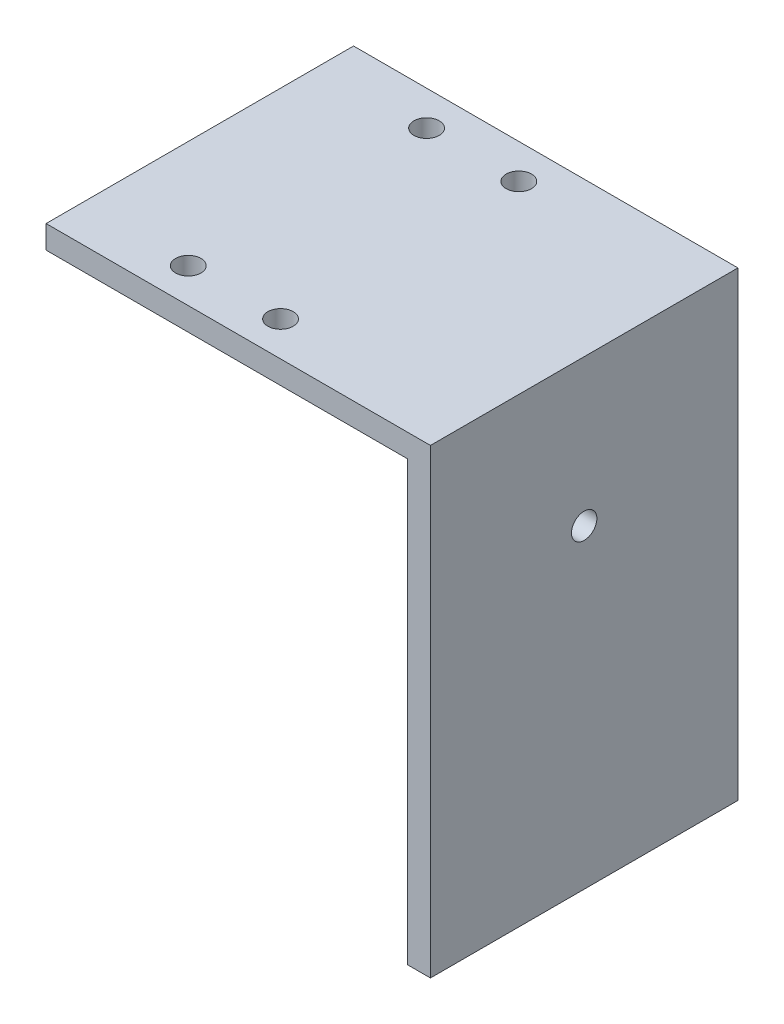
ISO-10303-21;
HEADER;
FILE_DESCRIPTION(('STEP AP214'),'2;1');
FILE_NAME('part.step','',(''),(''),'','','');
FILE_SCHEMA(('AUTOMOTIVE_DESIGN { 1 0 10303 214 1 1 1 1 }'));
ENDSEC;
DATA;
#1=APPLICATION_CONTEXT('core data for automotive mechanical design processes');
#2=APPLICATION_PROTOCOL_DEFINITION('international standard','automotive_design',2000,#1);
#3=PRODUCT_CONTEXT('',#1,'mechanical');
#4=PRODUCT('Part','Part','',(#3));
#5=PRODUCT_RELATED_PRODUCT_CATEGORY('part','',(#4));
#6=PRODUCT_DEFINITION_FORMATION('','',#4);
#7=PRODUCT_DEFINITION_CONTEXT('part definition',#1,'design');
#8=PRODUCT_DEFINITION('design','',#6,#7);
#9=PRODUCT_DEFINITION_SHAPE('','',#8);
#10=(LENGTH_UNIT() NAMED_UNIT(*) SI_UNIT(.MILLI.,.METRE.));
#11=(NAMED_UNIT(*) PLANE_ANGLE_UNIT() SI_UNIT($,.RADIAN.));
#12=(NAMED_UNIT(*) SI_UNIT($,.STERADIAN.) SOLID_ANGLE_UNIT());
#13=UNCERTAINTY_MEASURE_WITH_UNIT(LENGTH_MEASURE(1.E-05),#10,'distance_accuracy_value','');
#14=(GEOMETRIC_REPRESENTATION_CONTEXT(3) GLOBAL_UNCERTAINTY_ASSIGNED_CONTEXT((#13)) GLOBAL_UNIT_ASSIGNED_CONTEXT((#10,
#11,#12)) REPRESENTATION_CONTEXT('',''));
#15=CARTESIAN_POINT('',(0.,0.,0.));
#16=DIRECTION('',(0.,0.,1.));
#17=DIRECTION('',(1.,0.,0.));
#18=AXIS2_PLACEMENT_3D('',#15,#16,#17);
#19=CARTESIAN_POINT('',(0.,0.,40.));
#20=DIRECTION('',(1.,0.,0.));
#21=DIRECTION('',(0.,0.,-1.));
#22=AXIS2_PLACEMENT_3D('',#19,#20,#21);
#23=PLANE('',#22);
#24=DIRECTION('',(0.,-1.,0.));
#25=VECTOR('',#24,1.);
#26=CARTESIAN_POINT('',(0.,0.,0.));
#27=LINE('',#26,#25);
#28=CARTESIAN_POINT('',(0.,0.,0.));
#29=VERTEX_POINT('',#28);
#30=CARTESIAN_POINT('',(0.,-3.,0.));
#31=VERTEX_POINT('',#30);
#32=EDGE_CURVE('E122',#29,#31,#27,.T.);
#33=ORIENTED_EDGE('',*,*,#32,.T.);
#34=DIRECTION('',(0.,0.,-1.));
#35=VECTOR('',#34,1.);
#36=CARTESIAN_POINT('',(0.,-3.,40.));
#37=LINE('',#36,#35);
#38=CARTESIAN_POINT('',(0.,-3.,40.));
#39=VERTEX_POINT('',#38);
#40=EDGE_CURVE('E11',#39,#31,#37,.T.);
#41=ORIENTED_EDGE('',*,*,#40,.F.);
#42=DIRECTION('',(0.,-1.,0.));
#43=VECTOR('',#42,1.);
#44=CARTESIAN_POINT('',(0.,0.,40.));
#45=LINE('',#44,#43);
#46=CARTESIAN_POINT('',(0.,0.,40.));
#47=VERTEX_POINT('',#46);
#48=EDGE_CURVE('E133',#47,#39,#45,.T.);
#49=ORIENTED_EDGE('',*,*,#48,.F.);
#50=DIRECTION('',(0.,0.,-1.));
#51=VECTOR('',#50,1.);
#52=CARTESIAN_POINT('',(0.,0.,40.));
#53=LINE('',#52,#51);
#54=EDGE_CURVE('E118',#47,#29,#53,.T.);
#55=ORIENTED_EDGE('',*,*,#54,.T.);
#56=EDGE_LOOP('',(#33,#41,#49,#55));
#57=FACE_BOUND('',#56,.T.);
#58=ADVANCED_FACE('F38',(#57),#23,.F.);
#59=CARTESIAN_POINT('',(0.,-3.,40.));
#60=DIRECTION('',(0.,1.,0.));
#61=DIRECTION('',(0.,0.,1.));
#62=AXIS2_PLACEMENT_3D('',#59,#60,#61);
#63=PLANE('',#62);
#64=CARTESIAN_POINT('',(14.,-3.,35.5));
#65=DIRECTION('',(0.,1.,0.));
#66=DIRECTION('',(0.,0.,1.));
#67=AXIS2_PLACEMENT_3D('',#64,#65,#66);
#68=CIRCLE('',#67,1.65);
#69=CARTESIAN_POINT('',(14.,-3.,37.15));
#70=VERTEX_POINT('',#69);
#71=EDGE_CURVE('E126',#70,#70,#68,.T.);
#72=ORIENTED_EDGE('',*,*,#71,.T.);
#73=EDGE_LOOP('',(#72));
#74=FACE_BOUND('',#73,.T.);
#75=CARTESIAN_POINT('',(26.,-3.,4.5));
#76=DIRECTION('',(0.,1.,0.));
#77=DIRECTION('',(0.,0.,1.));
#78=AXIS2_PLACEMENT_3D('',#75,#76,#77);
#79=CIRCLE('',#78,1.65);
#80=CARTESIAN_POINT('',(26.,-3.,6.15));
#81=VERTEX_POINT('',#80);
#82=EDGE_CURVE('E279',#81,#81,#79,.T.);
#83=ORIENTED_EDGE('',*,*,#82,.T.);
#84=EDGE_LOOP('',(#83));
#85=FACE_BOUND('',#84,.T.);
#86=CARTESIAN_POINT('',(26.,-3.,35.5));
#87=DIRECTION('',(0.,1.,0.));
#88=DIRECTION('',(0.,0.,1.));
#89=AXIS2_PLACEMENT_3D('',#86,#87,#88);
#90=CIRCLE('',#89,1.65);
#91=CARTESIAN_POINT('',(26.,-3.,37.15));
#92=VERTEX_POINT('',#91);
#93=EDGE_CURVE('E276',#92,#92,#90,.T.);
#94=ORIENTED_EDGE('',*,*,#93,.T.);
#95=EDGE_LOOP('',(#94));
#96=FACE_BOUND('',#95,.T.);
#97=CARTESIAN_POINT('',(14.,-3.,4.5));
#98=DIRECTION('',(0.,1.,0.));
#99=DIRECTION('',(0.,0.,1.));
#100=AXIS2_PLACEMENT_3D('',#97,#98,#99);
#101=CIRCLE('',#100,1.65);
#102=CARTESIAN_POINT('',(14.,-3.,6.15));
#103=VERTEX_POINT('',#102);
#104=EDGE_CURVE('E274',#103,#103,#101,.T.);
#105=ORIENTED_EDGE('',*,*,#104,.T.);
#106=EDGE_LOOP('',(#105));
#107=FACE_BOUND('',#106,.T.);
#108=DIRECTION('',(1.,0.,0.));
#109=VECTOR('',#108,1.);
#110=CARTESIAN_POINT('',(0.,-3.,0.));
#111=LINE('',#110,#109);
#112=CARTESIAN_POINT('',(47.,-3.,0.));
#113=VERTEX_POINT('',#112);
#114=EDGE_CURVE('E125',#31,#113,#111,.T.);
#115=ORIENTED_EDGE('',*,*,#114,.T.);
#116=DIRECTION('',(0.,0.,-1.));
#117=VECTOR('',#116,1.);
#118=CARTESIAN_POINT('',(47.,-3.,40.));
#119=LINE('',#118,#117);
#120=CARTESIAN_POINT('',(47.,-3.,40.));
#121=VERTEX_POINT('',#120);
#122=EDGE_CURVE('E46',#121,#113,#119,.T.);
#123=ORIENTED_EDGE('',*,*,#122,.F.);
#124=DIRECTION('',(1.,0.,0.));
#125=VECTOR('',#124,1.);
#126=CARTESIAN_POINT('',(0.,-3.,40.));
#127=LINE('',#126,#125);
#128=EDGE_CURVE('E91',#39,#121,#127,.T.);
#129=ORIENTED_EDGE('',*,*,#128,.F.);
#130=ORIENTED_EDGE('',*,*,#40,.T.);
#131=EDGE_LOOP('',(#115,#123,#129,#130));
#132=FACE_BOUND('',#131,.T.);
#133=ADVANCED_FACE('F162',(#74,#85,#96,#107,#132),#63,.F.);
#134=CARTESIAN_POINT('',(47.,-3.,40.));
#135=DIRECTION('',(1.,0.,0.));
#136=DIRECTION('',(0.,1.,0.));
#137=AXIS2_PLACEMENT_3D('',#134,#135,#136);
#138=PLANE('',#137);
#139=CARTESIAN_POINT('',(47.,-19.05,20.));
#140=DIRECTION('',(1.,0.,0.));
#141=DIRECTION('',(0.,1.,0.));
#142=AXIS2_PLACEMENT_3D('',#139,#140,#141);
#143=CIRCLE('',#142,1.65);
#144=CARTESIAN_POINT('',(47.,-17.4,20.));
#145=VERTEX_POINT('',#144);
#146=EDGE_CURVE('E304',#145,#145,#143,.T.);
#147=ORIENTED_EDGE('',*,*,#146,.T.);
#148=EDGE_LOOP('',(#147));
#149=FACE_BOUND('',#148,.T.);
#150=DIRECTION('',(0.,-1.,0.));
#151=VECTOR('',#150,1.);
#152=CARTESIAN_POINT('',(47.,-3.,0.));
#153=LINE('',#152,#151);
#154=CARTESIAN_POINT('',(47.,-60.,0.));
#155=VERTEX_POINT('',#154);
#156=EDGE_CURVE('E128',#113,#155,#153,.T.);
#157=ORIENTED_EDGE('',*,*,#156,.T.);
#158=DIRECTION('',(0.,0.,-1.));
#159=VECTOR('',#158,1.);
#160=CARTESIAN_POINT('',(47.,-60.,40.));
#161=LINE('',#160,#159);
#162=CARTESIAN_POINT('',(47.,-60.,40.));
#163=VERTEX_POINT('',#162);
#164=EDGE_CURVE('E113',#163,#155,#161,.T.);
#165=ORIENTED_EDGE('',*,*,#164,.F.);
#166=DIRECTION('',(0.,-1.,0.));
#167=VECTOR('',#166,1.);
#168=CARTESIAN_POINT('',(47.,-3.,40.));
#169=LINE('',#168,#167);
#170=EDGE_CURVE('E104',#121,#163,#169,.T.);
#171=ORIENTED_EDGE('',*,*,#170,.F.);
#172=ORIENTED_EDGE('',*,*,#122,.T.);
#173=EDGE_LOOP('',(#157,#165,#171,#172));
#174=FACE_BOUND('',#173,.T.);
#175=ADVANCED_FACE('F139',(#149,#174),#138,.F.);
#176=CARTESIAN_POINT('',(47.,-60.,40.));
#177=DIRECTION('',(0.,1.,0.));
#178=DIRECTION('',(0.,0.,1.));
#179=AXIS2_PLACEMENT_3D('',#176,#177,#178);
#180=PLANE('',#179);
#181=DIRECTION('',(1.,0.,0.));
#182=VECTOR('',#181,1.);
#183=CARTESIAN_POINT('',(47.,-60.,0.));
#184=LINE('',#183,#182);
#185=CARTESIAN_POINT('',(50.,-60.,0.));
#186=VERTEX_POINT('',#185);
#187=EDGE_CURVE('E112',#155,#186,#184,.T.);
#188=ORIENTED_EDGE('',*,*,#187,.T.);
#189=DIRECTION('',(0.,0.,-1.));
#190=VECTOR('',#189,1.);
#191=CARTESIAN_POINT('',(50.,-60.,40.));
#192=LINE('',#191,#190);
#193=CARTESIAN_POINT('',(50.,-60.,40.));
#194=VERTEX_POINT('',#193);
#195=EDGE_CURVE('E109',#194,#186,#192,.T.);
#196=ORIENTED_EDGE('',*,*,#195,.F.);
#197=DIRECTION('',(1.,0.,0.));
#198=VECTOR('',#197,1.);
#199=CARTESIAN_POINT('',(47.,-60.,40.));
#200=LINE('',#199,#198);
#201=EDGE_CURVE('E98',#163,#194,#200,.T.);
#202=ORIENTED_EDGE('',*,*,#201,.F.);
#203=ORIENTED_EDGE('',*,*,#164,.T.);
#204=EDGE_LOOP('',(#188,#196,#202,#203));
#205=FACE_BOUND('',#204,.T.);
#206=ADVANCED_FACE('F110',(#205),#180,.F.);
#207=CARTESIAN_POINT('',(50.,0.,40.));
#208=DIRECTION('',(-1.,0.,0.));
#209=DIRECTION('',(0.,0.,1.));
#210=AXIS2_PLACEMENT_3D('',#207,#208,#209);
#211=PLANE('',#210);
#212=CARTESIAN_POINT('',(50.,-19.05,20.));
#213=DIRECTION('',(1.,0.,0.));
#214=DIRECTION('',(0.,0.,-1.));
#215=AXIS2_PLACEMENT_3D('',#212,#213,#214);
#216=CIRCLE('',#215,1.65);
#217=CARTESIAN_POINT('',(50.,-19.05,18.35));
#218=VERTEX_POINT('',#217);
#219=EDGE_CURVE('E307',#218,#218,#216,.T.);
#220=ORIENTED_EDGE('',*,*,#219,.F.);
#221=EDGE_LOOP('',(#220));
#222=FACE_BOUND('',#221,.T.);
#223=DIRECTION('',(0.,1.,0.));
#224=VECTOR('',#223,1.);
#225=CARTESIAN_POINT('',(50.,0.,0.));
#226=LINE('',#225,#224);
#227=CARTESIAN_POINT('',(50.,0.,0.));
#228=VERTEX_POINT('',#227);
#229=EDGE_CURVE('E77',#186,#228,#226,.T.);
#230=ORIENTED_EDGE('',*,*,#229,.T.);
#231=DIRECTION('',(0.,0.,-1.));
#232=VECTOR('',#231,1.);
#233=CARTESIAN_POINT('',(50.,0.,40.));
#234=LINE('',#233,#232);
#235=CARTESIAN_POINT('',(50.,0.,40.));
#236=VERTEX_POINT('',#235);
#237=EDGE_CURVE('E114',#236,#228,#234,.T.);
#238=ORIENTED_EDGE('',*,*,#237,.F.);
#239=DIRECTION('',(0.,1.,0.));
#240=VECTOR('',#239,1.);
#241=CARTESIAN_POINT('',(50.,0.,40.));
#242=LINE('',#241,#240);
#243=EDGE_CURVE('E102',#194,#236,#242,.T.);
#244=ORIENTED_EDGE('',*,*,#243,.F.);
#245=ORIENTED_EDGE('',*,*,#195,.T.);
#246=EDGE_LOOP('',(#230,#238,#244,#245));
#247=FACE_BOUND('',#246,.T.);
#248=ADVANCED_FACE('F116',(#222,#247),#211,.F.);
#249=CARTESIAN_POINT('',(0.,0.,40.));
#250=DIRECTION('',(0.,-1.,0.));
#251=DIRECTION('',(0.,0.,-1.));
#252=AXIS2_PLACEMENT_3D('',#249,#250,#251);
#253=PLANE('',#252);
#254=CARTESIAN_POINT('',(14.,0.,35.5));
#255=DIRECTION('',(0.,1.,0.));
#256=DIRECTION('',(0.,0.,1.));
#257=AXIS2_PLACEMENT_3D('',#254,#255,#256);
#258=CIRCLE('',#257,1.65);
#259=CARTESIAN_POINT('',(14.,0.,37.15));
#260=VERTEX_POINT('',#259);
#261=EDGE_CURVE('E281',#260,#260,#258,.T.);
#262=ORIENTED_EDGE('',*,*,#261,.F.);
#263=EDGE_LOOP('',(#262));
#264=FACE_BOUND('',#263,.T.);
#265=CARTESIAN_POINT('',(26.,0.,4.5));
#266=DIRECTION('',(0.,1.,0.));
#267=DIRECTION('',(0.,0.,1.));
#268=AXIS2_PLACEMENT_3D('',#265,#266,#267);
#269=CIRCLE('',#268,1.65);
#270=CARTESIAN_POINT('',(26.,0.,6.15));
#271=VERTEX_POINT('',#270);
#272=EDGE_CURVE('E296',#271,#271,#269,.T.);
#273=ORIENTED_EDGE('',*,*,#272,.F.);
#274=EDGE_LOOP('',(#273));
#275=FACE_BOUND('',#274,.T.);
#276=CARTESIAN_POINT('',(26.,0.,35.5));
#277=DIRECTION('',(0.,1.,0.));
#278=DIRECTION('',(0.,0.,1.));
#279=AXIS2_PLACEMENT_3D('',#276,#277,#278);
#280=CIRCLE('',#279,1.65);
#281=CARTESIAN_POINT('',(26.,0.,37.15));
#282=VERTEX_POINT('',#281);
#283=EDGE_CURVE('E299',#282,#282,#280,.T.);
#284=ORIENTED_EDGE('',*,*,#283,.F.);
#285=EDGE_LOOP('',(#284));
#286=FACE_BOUND('',#285,.T.);
#287=CARTESIAN_POINT('',(14.,0.,4.5));
#288=DIRECTION('',(0.,1.,0.));
#289=DIRECTION('',(0.,0.,1.));
#290=AXIS2_PLACEMENT_3D('',#287,#288,#289);
#291=CIRCLE('',#290,1.65);
#292=CARTESIAN_POINT('',(14.,0.,6.15));
#293=VERTEX_POINT('',#292);
#294=EDGE_CURVE('E271',#293,#293,#291,.T.);
#295=ORIENTED_EDGE('',*,*,#294,.F.);
#296=EDGE_LOOP('',(#295));
#297=FACE_BOUND('',#296,.T.);
#298=DIRECTION('',(-1.,0.,0.));
#299=VECTOR('',#298,1.);
#300=CARTESIAN_POINT('',(0.,0.,0.));
#301=LINE('',#300,#299);
#302=EDGE_CURVE('E83',#228,#29,#301,.T.);
#303=ORIENTED_EDGE('',*,*,#302,.T.);
#304=ORIENTED_EDGE('',*,*,#54,.F.);
#305=DIRECTION('',(-1.,0.,0.));
#306=VECTOR('',#305,1.);
#307=CARTESIAN_POINT('',(0.,0.,40.));
#308=LINE('',#307,#306);
#309=EDGE_CURVE('E54',#236,#47,#308,.T.);
#310=ORIENTED_EDGE('',*,*,#309,.F.);
#311=ORIENTED_EDGE('',*,*,#237,.T.);
#312=EDGE_LOOP('',(#303,#304,#310,#311));
#313=FACE_BOUND('',#312,.T.);
#314=ADVANCED_FACE('F146',(#264,#275,#286,#297,#313),#253,.F.);
#315=CARTESIAN_POINT('',(0.,0.,40.));
#316=DIRECTION('',(0.,0.,1.));
#317=DIRECTION('',(1.,0.,0.));
#318=AXIS2_PLACEMENT_3D('',#315,#316,#317);
#319=PLANE('',#318);
#320=ORIENTED_EDGE('',*,*,#48,.T.);
#321=ORIENTED_EDGE('',*,*,#128,.T.);
#322=ORIENTED_EDGE('',*,*,#170,.T.);
#323=ORIENTED_EDGE('',*,*,#201,.T.);
#324=ORIENTED_EDGE('',*,*,#243,.T.);
#325=ORIENTED_EDGE('',*,*,#309,.T.);
#326=EDGE_LOOP('',(#320,#321,#322,#323,#324,#325));
#327=FACE_BOUND('',#326,.T.);
#328=ADVANCED_FACE('F100',(#327),#319,.T.);
#329=CARTESIAN_POINT('',(0.,0.,0.));
#330=DIRECTION('',(0.,0.,1.));
#331=DIRECTION('',(1.,0.,0.));
#332=AXIS2_PLACEMENT_3D('',#329,#330,#331);
#333=PLANE('',#332);
#334=ORIENTED_EDGE('',*,*,#32,.F.);
#335=ORIENTED_EDGE('',*,*,#302,.F.);
#336=ORIENTED_EDGE('',*,*,#229,.F.);
#337=ORIENTED_EDGE('',*,*,#187,.F.);
#338=ORIENTED_EDGE('',*,*,#156,.F.);
#339=ORIENTED_EDGE('',*,*,#114,.F.);
#340=EDGE_LOOP('',(#334,#335,#336,#337,#338,#339));
#341=FACE_BOUND('',#340,.T.);
#342=ADVANCED_FACE('F142',(#341),#333,.F.);
#343=CARTESIAN_POINT('',(14.,-10.,4.5));
#344=DIRECTION('',(0.,1.,0.));
#345=DIRECTION('',(0.,0.,1.));
#346=AXIS2_PLACEMENT_3D('',#343,#344,#345);
#347=CYLINDRICAL_SURFACE('',#346,1.65);
#348=ORIENTED_EDGE('',*,*,#294,.T.);
#349=EDGE_LOOP('',(#348));
#350=FACE_BOUND('',#349,.T.);
#351=ORIENTED_EDGE('',*,*,#104,.F.);
#352=EDGE_LOOP('',(#351));
#353=FACE_BOUND('',#352,.T.);
#354=ADVANCED_FACE('F222',(#350,#353),#347,.F.);
#355=CARTESIAN_POINT('',(26.,-10.,35.5));
#356=DIRECTION('',(0.,1.,0.));
#357=DIRECTION('',(0.,0.,1.));
#358=AXIS2_PLACEMENT_3D('',#355,#356,#357);
#359=CYLINDRICAL_SURFACE('',#358,1.65);
#360=ORIENTED_EDGE('',*,*,#283,.T.);
#361=EDGE_LOOP('',(#360));
#362=FACE_BOUND('',#361,.T.);
#363=ORIENTED_EDGE('',*,*,#93,.F.);
#364=EDGE_LOOP('',(#363));
#365=FACE_BOUND('',#364,.T.);
#366=ADVANCED_FACE('F214',(#362,#365),#359,.F.);
#367=CARTESIAN_POINT('',(26.,-10.,4.5));
#368=DIRECTION('',(0.,1.,0.));
#369=DIRECTION('',(0.,0.,1.));
#370=AXIS2_PLACEMENT_3D('',#367,#368,#369);
#371=CYLINDRICAL_SURFACE('',#370,1.65);
#372=ORIENTED_EDGE('',*,*,#272,.T.);
#373=EDGE_LOOP('',(#372));
#374=FACE_BOUND('',#373,.T.);
#375=ORIENTED_EDGE('',*,*,#82,.F.);
#376=EDGE_LOOP('',(#375));
#377=FACE_BOUND('',#376,.T.);
#378=ADVANCED_FACE('F207',(#374,#377),#371,.F.);
#379=CARTESIAN_POINT('',(14.,-10.,35.5));
#380=DIRECTION('',(0.,1.,0.));
#381=DIRECTION('',(0.,0.,1.));
#382=AXIS2_PLACEMENT_3D('',#379,#380,#381);
#383=CYLINDRICAL_SURFACE('',#382,1.65);
#384=ORIENTED_EDGE('',*,*,#261,.T.);
#385=EDGE_LOOP('',(#384));
#386=FACE_BOUND('',#385,.T.);
#387=ORIENTED_EDGE('',*,*,#71,.F.);
#388=EDGE_LOOP('',(#387));
#389=FACE_BOUND('',#388,.T.);
#390=ADVANCED_FACE('F197',(#386,#389),#383,.F.);
#391=CARTESIAN_POINT('',(40.,-19.05,20.));
#392=DIRECTION('',(1.,0.,0.));
#393=DIRECTION('',(0.,0.,-1.));
#394=AXIS2_PLACEMENT_3D('',#391,#392,#393);
#395=CYLINDRICAL_SURFACE('',#394,1.65);
#396=ORIENTED_EDGE('',*,*,#219,.T.);
#397=EDGE_LOOP('',(#396));
#398=FACE_BOUND('',#397,.T.);
#399=ORIENTED_EDGE('',*,*,#146,.F.);
#400=EDGE_LOOP('',(#399));
#401=FACE_BOUND('',#400,.T.);
#402=ADVANCED_FACE('F193',(#398,#401),#395,.F.);
#403=CLOSED_SHELL('',(#58,#133,#175,#206,#248,#314,#328,#342,#354,#366,#378,#390,#402));
#404=MANIFOLD_SOLID_BREP('B2',#403);
#405=ADVANCED_BREP_SHAPE_REPRESENTATION('',(#18,#404),#14);
#406=SHAPE_DEFINITION_REPRESENTATION(#9,#405);
ENDSEC;
END-ISO-10303-21;
